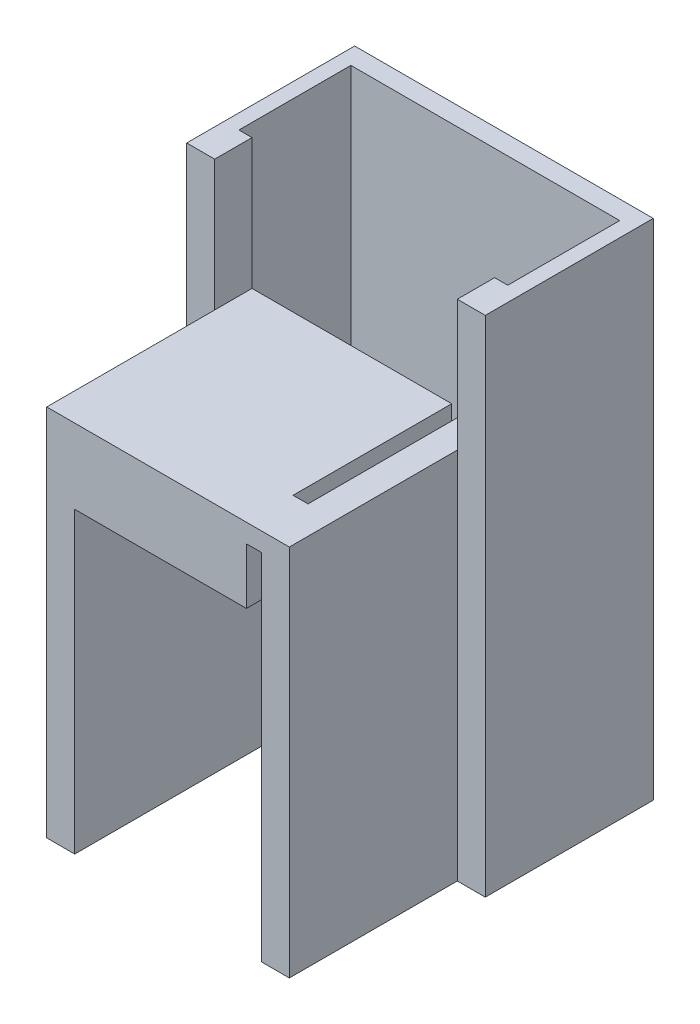
ISO-10303-21;
HEADER;
FILE_DESCRIPTION(('STEP AP214'),'2;1');
FILE_NAME('part.step','',(''),(''),'','','');
FILE_SCHEMA(('AUTOMOTIVE_DESIGN { 1 0 10303 214 1 1 1 1 }'));
ENDSEC;
DATA;
#1=APPLICATION_CONTEXT('core data for automotive mechanical design processes');
#2=APPLICATION_PROTOCOL_DEFINITION('international standard','automotive_design',2000,#1);
#3=PRODUCT_CONTEXT('',#1,'mechanical');
#4=PRODUCT('Part','Part','',(#3));
#5=PRODUCT_RELATED_PRODUCT_CATEGORY('part','',(#4));
#6=PRODUCT_DEFINITION_FORMATION('','',#4);
#7=PRODUCT_DEFINITION_CONTEXT('part definition',#1,'design');
#8=PRODUCT_DEFINITION('design','',#6,#7);
#9=PRODUCT_DEFINITION_SHAPE('','',#8);
#10=(LENGTH_UNIT() NAMED_UNIT(*) SI_UNIT(.MILLI.,.METRE.));
#11=(NAMED_UNIT(*) PLANE_ANGLE_UNIT() SI_UNIT($,.RADIAN.));
#12=(NAMED_UNIT(*) SI_UNIT($,.STERADIAN.) SOLID_ANGLE_UNIT());
#13=UNCERTAINTY_MEASURE_WITH_UNIT(LENGTH_MEASURE(1.E-05),#10,'distance_accuracy_value','');
#14=(GEOMETRIC_REPRESENTATION_CONTEXT(3) GLOBAL_UNCERTAINTY_ASSIGNED_CONTEXT((#13)) GLOBAL_UNIT_ASSIGNED_CONTEXT((#10,
#11,#12)) REPRESENTATION_CONTEXT('',''));
#15=CARTESIAN_POINT('',(0.,0.,0.));
#16=DIRECTION('',(0.,0.,1.));
#17=DIRECTION('',(1.,0.,0.));
#18=AXIS2_PLACEMENT_3D('',#15,#16,#17);
#19=CARTESIAN_POINT('',(-14.605,0.,-13.97));
#20=DIRECTION('',(-1.,0.,0.));
#21=DIRECTION('',(0.,0.,1.));
#22=AXIS2_PLACEMENT_3D('',#19,#20,#21);
#23=PLANE('',#22);
#24=DIRECTION('',(0.,0.,1.));
#25=VECTOR('',#24,1.);
#26=CARTESIAN_POINT('',(-14.605,25.4,-13.97));
#27=LINE('',#26,#25);
#28=CARTESIAN_POINT('',(-14.605,25.4,-11.43));
#29=VERTEX_POINT('',#28);
#30=CARTESIAN_POINT('',(-14.605,25.4,0.));
#31=VERTEX_POINT('',#30);
#32=EDGE_CURVE('E426',#29,#31,#27,.T.);
#33=ORIENTED_EDGE('',*,*,#32,.F.);
#34=DIRECTION('',(0.,-1.,0.));
#35=VECTOR('',#34,1.);
#36=CARTESIAN_POINT('',(-14.605,34.29,-11.43));
#37=LINE('',#36,#35);
#38=CARTESIAN_POINT('',(-14.605,0.,-11.43));
#39=VERTEX_POINT('',#38);
#40=EDGE_CURVE('E314',#29,#39,#37,.T.);
#41=ORIENTED_EDGE('',*,*,#40,.T.);
#42=DIRECTION('',(0.,0.,1.));
#43=VECTOR('',#42,1.);
#44=CARTESIAN_POINT('',(-14.605,0.,-13.97));
#45=LINE('',#44,#43);
#46=CARTESIAN_POINT('',(-14.605,0.,0.));
#47=VERTEX_POINT('',#46);
#48=EDGE_CURVE('E420',#39,#47,#45,.T.);
#49=ORIENTED_EDGE('',*,*,#48,.T.);
#50=DIRECTION('',(0.,-1.,0.));
#51=VECTOR('',#50,1.);
#52=CARTESIAN_POINT('',(-14.605,0.,0.));
#53=LINE('',#52,#51);
#54=EDGE_CURVE('E395',#31,#47,#53,.T.);
#55=ORIENTED_EDGE('',*,*,#54,.F.);
#56=EDGE_LOOP('',(#33,#41,#49,#55));
#57=FACE_BOUND('',#56,.T.);
#58=ADVANCED_FACE('F42',(#57),#23,.T.);
#59=CARTESIAN_POINT('',(1.905,25.4,-13.97));
#60=DIRECTION('',(1.,0.,0.));
#61=DIRECTION('',(0.,1.,0.));
#62=AXIS2_PLACEMENT_3D('',#59,#60,#61);
#63=PLANE('',#62);
#64=DIRECTION('',(0.,0.,1.));
#65=VECTOR('',#64,1.);
#66=CARTESIAN_POINT('',(1.905,0.,-13.97));
#67=LINE('',#66,#65);
#68=CARTESIAN_POINT('',(1.905,0.,-11.43));
#69=VERTEX_POINT('',#68);
#70=CARTESIAN_POINT('',(1.905,0.,0.));
#71=VERTEX_POINT('',#70);
#72=EDGE_CURVE('E46',#69,#71,#67,.T.);
#73=ORIENTED_EDGE('',*,*,#72,.F.);
#74=DIRECTION('',(0.,-1.,0.));
#75=VECTOR('',#74,1.);
#76=CARTESIAN_POINT('',(1.905,34.29,-11.43));
#77=LINE('',#76,#75);
#78=CARTESIAN_POINT('',(1.905,25.4,-11.43));
#79=VERTEX_POINT('',#78);
#80=EDGE_CURVE('E286',#79,#69,#77,.T.);
#81=ORIENTED_EDGE('',*,*,#80,.F.);
#82=DIRECTION('',(0.,0.,1.));
#83=VECTOR('',#82,1.);
#84=CARTESIAN_POINT('',(1.905,25.4,-13.97));
#85=LINE('',#84,#83);
#86=CARTESIAN_POINT('',(1.905,25.4,0.));
#87=VERTEX_POINT('',#86);
#88=EDGE_CURVE('E430',#79,#87,#85,.T.);
#89=ORIENTED_EDGE('',*,*,#88,.T.);
#90=DIRECTION('',(0.,1.,0.));
#91=VECTOR('',#90,1.);
#92=CARTESIAN_POINT('',(1.905,25.4,0.));
#93=LINE('',#92,#91);
#94=EDGE_CURVE('E387',#71,#87,#93,.T.);
#95=ORIENTED_EDGE('',*,*,#94,.F.);
#96=EDGE_LOOP('',(#73,#81,#89,#95));
#97=FACE_BOUND('',#96,.T.);
#98=ADVANCED_FACE('F44',(#97),#63,.T.);
#99=CARTESIAN_POINT('',(0.,0.,-13.97));
#100=DIRECTION('',(0.,0.,-1.));
#101=DIRECTION('',(-1.,0.,0.));
#102=AXIS2_PLACEMENT_3D('',#99,#100,#101);
#103=PLANE('',#102);
#104=DIRECTION('',(-1.,0.,0.));
#105=VECTOR('',#104,1.);
#106=CARTESIAN_POINT('',(-15.4971636435347,1.27,-13.97));
#107=LINE('',#106,#105);
#108=CARTESIAN_POINT('',(-12.7,1.27,-13.97));
#109=VERTEX_POINT('',#108);
#110=CARTESIAN_POINT('',(-15.4971636435347,1.27,-13.97));
#111=VERTEX_POINT('',#110);
#112=EDGE_CURVE('E468',#109,#111,#107,.T.);
#113=ORIENTED_EDGE('',*,*,#112,.T.);
#114=DIRECTION('',(0.,-1.,0.));
#115=VECTOR('',#114,1.);
#116=CARTESIAN_POINT('',(-15.4971636435347,34.29,-13.97));
#117=LINE('',#116,#115);
#118=CARTESIAN_POINT('',(-15.4971636435347,34.29,-13.97));
#119=VERTEX_POINT('',#118);
#120=EDGE_CURVE('E306',#119,#111,#117,.T.);
#121=ORIENTED_EDGE('',*,*,#120,.F.);
#122=DIRECTION('',(-1.,0.,0.));
#123=VECTOR('',#122,1.);
#124=CARTESIAN_POINT('',(-15.4971636435347,34.29,-13.97));
#125=LINE('',#124,#123);
#126=CARTESIAN_POINT('',(-14.605,34.29,-13.97));
#127=VERTEX_POINT('',#126);
#128=EDGE_CURVE('E268',#127,#119,#125,.T.);
#129=ORIENTED_EDGE('',*,*,#128,.F.);
#130=DIRECTION('',(0.,-1.,0.));
#131=VECTOR('',#130,1.);
#132=CARTESIAN_POINT('',(-14.605,34.29,-13.97));
#133=LINE('',#132,#131);
#134=CARTESIAN_POINT('',(-14.605,25.4,-13.97));
#135=VERTEX_POINT('',#134);
#136=EDGE_CURVE('E310',#127,#135,#133,.T.);
#137=ORIENTED_EDGE('',*,*,#136,.T.);
#138=DIRECTION('',(-1.,0.,0.));
#139=VECTOR('',#138,1.);
#140=CARTESIAN_POINT('',(-14.605,25.4,-13.97));
#141=LINE('',#140,#139);
#142=CARTESIAN_POINT('',(-1.016,25.4,-13.97));
#143=VERTEX_POINT('',#142);
#144=EDGE_CURVE('E373',#143,#135,#141,.T.);
#145=ORIENTED_EDGE('',*,*,#144,.F.);
#146=DIRECTION('',(0.,-1.,0.));
#147=VECTOR('',#146,1.);
#148=CARTESIAN_POINT('',(-1.016,24.13,-13.97));
#149=LINE('',#148,#147);
#150=CARTESIAN_POINT('',(-1.016,20.32,-13.97));
#151=VERTEX_POINT('',#150);
#152=EDGE_CURVE('E348',#143,#151,#149,.T.);
#153=ORIENTED_EDGE('',*,*,#152,.T.);
#154=DIRECTION('',(1.,0.,0.));
#155=VECTOR('',#154,1.);
#156=CARTESIAN_POINT('',(0.,20.32,-13.97));
#157=LINE('',#156,#155);
#158=CARTESIAN_POINT('',(-12.7,20.32,-13.97));
#159=VERTEX_POINT('',#158);
#160=EDGE_CURVE('E377',#159,#151,#157,.T.);
#161=ORIENTED_EDGE('',*,*,#160,.F.);
#162=DIRECTION('',(0.,1.,0.));
#163=VECTOR('',#162,1.);
#164=CARTESIAN_POINT('',(-12.7,20.32,-13.97));
#165=LINE('',#164,#163);
#166=EDGE_CURVE('E60',#109,#159,#165,.T.);
#167=ORIENTED_EDGE('',*,*,#166,.F.);
#168=EDGE_LOOP('',(#113,#121,#129,#137,#145,#153,#161,#167));
#169=FACE_BOUND('',#168,.T.);
#170=ADVANCED_FACE('F491',(#169),#103,.T.);
#171=CARTESIAN_POINT('',(0.,0.,-13.97));
#172=DIRECTION('',(-1.,0.,0.));
#173=DIRECTION('',(0.,-1.,0.));
#174=AXIS2_PLACEMENT_3D('',#171,#172,#173);
#175=PLANE('',#174);
#176=DIRECTION('',(0.,-1.,0.));
#177=VECTOR('',#176,1.);
#178=CARTESIAN_POINT('',(0.,0.,0.));
#179=LINE('',#178,#177);
#180=CARTESIAN_POINT('',(0.,24.13,0.));
#181=VERTEX_POINT('',#180);
#182=CARTESIAN_POINT('',(0.,0.,0.));
#183=VERTEX_POINT('',#182);
#184=EDGE_CURVE('E411',#181,#183,#179,.T.);
#185=ORIENTED_EDGE('',*,*,#184,.F.);
#186=DIRECTION('',(0.,0.,1.));
#187=VECTOR('',#186,1.);
#188=CARTESIAN_POINT('',(0.,24.13,-13.97));
#189=LINE('',#188,#187);
#190=CARTESIAN_POINT('',(0.,24.13,-3.175));
#191=VERTEX_POINT('',#190);
#192=EDGE_CURVE('E352',#191,#181,#189,.T.);
#193=ORIENTED_EDGE('',*,*,#192,.F.);
#194=DIRECTION('',(0.,-1.,0.));
#195=VECTOR('',#194,1.);
#196=CARTESIAN_POINT('',(0.,25.4,-3.175));
#197=LINE('',#196,#195);
#198=CARTESIAN_POINT('',(0.,25.4,-3.175));
#199=VERTEX_POINT('',#198);
#200=EDGE_CURVE('E338',#199,#191,#197,.T.);
#201=ORIENTED_EDGE('',*,*,#200,.F.);
#202=DIRECTION('',(0.,0.,1.));
#203=VECTOR('',#202,1.);
#204=CARTESIAN_POINT('',(0.,25.4,-3.175));
#205=LINE('',#204,#203);
#206=CARTESIAN_POINT('',(0.,25.4,-13.97));
#207=VERTEX_POINT('',#206);
#208=EDGE_CURVE('E330',#207,#199,#205,.T.);
#209=ORIENTED_EDGE('',*,*,#208,.F.);
#210=DIRECTION('',(0.,-1.,0.));
#211=VECTOR('',#210,1.);
#212=CARTESIAN_POINT('',(0.,0.,-13.97));
#213=LINE('',#212,#211);
#214=CARTESIAN_POINT('',(0.,1.27,-13.97));
#215=VERTEX_POINT('',#214);
#216=EDGE_CURVE('E381',#207,#215,#213,.T.);
#217=ORIENTED_EDGE('',*,*,#216,.T.);
#218=DIRECTION('',(0.,1.,0.));
#219=VECTOR('',#218,1.);
#220=CARTESIAN_POINT('',(0.,0.,-13.97));
#221=LINE('',#220,#219);
#222=CARTESIAN_POINT('',(0.,0.,-13.97));
#223=VERTEX_POINT('',#222);
#224=EDGE_CURVE('E235',#223,#215,#221,.T.);
#225=ORIENTED_EDGE('',*,*,#224,.F.);
#226=DIRECTION('',(0.,0.,1.));
#227=VECTOR('',#226,1.);
#228=CARTESIAN_POINT('',(0.,0.,-13.97));
#229=LINE('',#228,#227);
#230=EDGE_CURVE('E11',#223,#183,#229,.T.);
#231=ORIENTED_EDGE('',*,*,#230,.T.);
#232=EDGE_LOOP('',(#185,#193,#201,#209,#217,#225,#231));
#233=FACE_BOUND('',#232,.T.);
#234=ADVANCED_FACE('F451',(#233),#175,.T.);
#235=CARTESIAN_POINT('',(0.,20.32,-13.97));
#236=DIRECTION('',(0.,-1.,0.));
#237=DIRECTION('',(0.,0.,-1.));
#238=AXIS2_PLACEMENT_3D('',#235,#236,#237);
#239=PLANE('',#238);
#240=DIRECTION('',(0.,0.,1.));
#241=VECTOR('',#240,1.);
#242=CARTESIAN_POINT('',(-1.016,20.32,-13.97));
#243=LINE('',#242,#241);
#244=CARTESIAN_POINT('',(-1.016,20.32,0.));
#245=VERTEX_POINT('',#244);
#246=EDGE_CURVE('E359',#151,#245,#243,.T.);
#247=ORIENTED_EDGE('',*,*,#246,.T.);
#248=DIRECTION('',(1.,0.,0.));
#249=VECTOR('',#248,1.);
#250=CARTESIAN_POINT('',(0.,20.32,0.));
#251=LINE('',#250,#249);
#252=CARTESIAN_POINT('',(-12.7,20.32,0.));
#253=VERTEX_POINT('',#252);
#254=EDGE_CURVE('E407',#253,#245,#251,.T.);
#255=ORIENTED_EDGE('',*,*,#254,.F.);
#256=DIRECTION('',(0.,0.,1.));
#257=VECTOR('',#256,1.);
#258=CARTESIAN_POINT('',(-12.7,20.32,-13.97));
#259=LINE('',#258,#257);
#260=EDGE_CURVE('E52',#159,#253,#259,.T.);
#261=ORIENTED_EDGE('',*,*,#260,.F.);
#262=ORIENTED_EDGE('',*,*,#160,.T.);
#263=EDGE_LOOP('',(#247,#255,#261,#262));
#264=FACE_BOUND('',#263,.T.);
#265=ADVANCED_FACE('F525',(#264),#239,.T.);
#266=CARTESIAN_POINT('',(-12.7,20.32,-13.97));
#267=DIRECTION('',(1.,0.,0.));
#268=DIRECTION('',(0.,1.,0.));
#269=AXIS2_PLACEMENT_3D('',#266,#267,#268);
#270=PLANE('',#269);
#271=DIRECTION('',(0.,1.,0.));
#272=VECTOR('',#271,1.);
#273=CARTESIAN_POINT('',(-12.7,20.32,0.));
#274=LINE('',#273,#272);
#275=CARTESIAN_POINT('',(-12.7,0.,0.));
#276=VERTEX_POINT('',#275);
#277=EDGE_CURVE('E403',#276,#253,#274,.T.);
#278=ORIENTED_EDGE('',*,*,#277,.F.);
#279=DIRECTION('',(0.,0.,1.));
#280=VECTOR('',#279,1.);
#281=CARTESIAN_POINT('',(-12.7,0.,-13.97));
#282=LINE('',#281,#280);
#283=CARTESIAN_POINT('',(-12.7,0.,-13.97));
#284=VERTEX_POINT('',#283);
#285=EDGE_CURVE('E417',#284,#276,#282,.T.);
#286=ORIENTED_EDGE('',*,*,#285,.F.);
#287=EDGE_CURVE('E374',#284,#109,#165,.T.);
#288=ORIENTED_EDGE('',*,*,#287,.T.);
#289=ORIENTED_EDGE('',*,*,#166,.T.);
#290=ORIENTED_EDGE('',*,*,#260,.T.);
#291=EDGE_LOOP('',(#278,#286,#288,#289,#290));
#292=FACE_BOUND('',#291,.T.);
#293=ADVANCED_FACE('F521',(#292),#270,.T.);
#294=CARTESIAN_POINT('',(-12.7,0.,-13.97));
#295=DIRECTION('',(0.,-1.,0.));
#296=DIRECTION('',(1.,0.,0.));
#297=AXIS2_PLACEMENT_3D('',#294,#295,#296);
#298=PLANE('',#297);
#299=DIRECTION('',(-1.,0.,0.));
#300=VECTOR('',#299,1.);
#301=CARTESIAN_POINT('',(-15.4971636435347,0.,-13.97));
#302=LINE('',#301,#300);
#303=EDGE_CURVE('E453',#223,#284,#302,.T.);
#304=ORIENTED_EDGE('',*,*,#303,.T.);
#305=ORIENTED_EDGE('',*,*,#285,.T.);
#306=DIRECTION('',(1.,0.,0.));
#307=VECTOR('',#306,1.);
#308=CARTESIAN_POINT('',(-12.7,0.,0.));
#309=LINE('',#308,#307);
#310=EDGE_CURVE('E399',#47,#276,#309,.T.);
#311=ORIENTED_EDGE('',*,*,#310,.F.);
#312=ORIENTED_EDGE('',*,*,#48,.F.);
#313=DIRECTION('',(1.,0.,0.));
#314=VECTOR('',#313,1.);
#315=CARTESIAN_POINT('',(-16.51,0.,-11.43));
#316=LINE('',#315,#314);
#317=CARTESIAN_POINT('',(-16.51,0.,-11.43));
#318=VERTEX_POINT('',#317);
#319=EDGE_CURVE('E246',#318,#39,#316,.T.);
#320=ORIENTED_EDGE('',*,*,#319,.F.);
#321=DIRECTION('',(0.,0.,1.));
#322=VECTOR('',#321,1.);
#323=CARTESIAN_POINT('',(-16.51,0.,-22.86));
#324=LINE('',#323,#322);
#325=CARTESIAN_POINT('',(-16.51,0.,-22.86));
#326=VERTEX_POINT('',#325);
#327=EDGE_CURVE('E229',#326,#318,#324,.T.);
#328=ORIENTED_EDGE('',*,*,#327,.F.);
#329=DIRECTION('',(-1.,0.,0.));
#330=VECTOR('',#329,1.);
#331=CARTESIAN_POINT('',(3.80999999999999,0.,-22.86));
#332=LINE('',#331,#330);
#333=CARTESIAN_POINT('',(3.80999999999999,0.,-22.86));
#334=VERTEX_POINT('',#333);
#335=EDGE_CURVE('E211',#334,#326,#332,.T.);
#336=ORIENTED_EDGE('',*,*,#335,.F.);
#337=DIRECTION('',(0.,0.,-1.));
#338=VECTOR('',#337,1.);
#339=CARTESIAN_POINT('',(3.80999999999999,0.,-11.43));
#340=LINE('',#339,#338);
#341=CARTESIAN_POINT('',(3.80999999999999,0.,-11.43));
#342=VERTEX_POINT('',#341);
#343=EDGE_CURVE('E225',#342,#334,#340,.T.);
#344=ORIENTED_EDGE('',*,*,#343,.F.);
#345=DIRECTION('',(1.,0.,0.));
#346=VECTOR('',#345,1.);
#347=CARTESIAN_POINT('',(1.905,0.,-11.43));
#348=LINE('',#347,#346);
#349=EDGE_CURVE('E242',#69,#342,#348,.T.);
#350=ORIENTED_EDGE('',*,*,#349,.F.);
#351=ORIENTED_EDGE('',*,*,#72,.T.);
#352=DIRECTION('',(1.,0.,0.));
#353=VECTOR('',#352,1.);
#354=CARTESIAN_POINT('',(1.905,0.,0.));
#355=LINE('',#354,#353);
#356=EDGE_CURVE('E363',#183,#71,#355,.T.);
#357=ORIENTED_EDGE('',*,*,#356,.F.);
#358=ORIENTED_EDGE('',*,*,#230,.F.);
#359=EDGE_LOOP('',(#304,#305,#311,#312,#320,#328,#336,#344,#350,#351,#357,#358));
#360=FACE_BOUND('',#359,.T.);
#361=ADVANCED_FACE('F223',(#360),#298,.T.);
#362=CARTESIAN_POINT('',(-14.605,25.4,-13.97));
#363=DIRECTION('',(0.,1.,0.));
#364=DIRECTION('',(0.,0.,1.));
#365=AXIS2_PLACEMENT_3D('',#362,#363,#364);
#366=PLANE('',#365);
#367=DIRECTION('',(0.,0.,-1.));
#368=VECTOR('',#367,1.);
#369=CARTESIAN_POINT('',(-1.016,25.4,-13.97));
#370=LINE('',#369,#368);
#371=CARTESIAN_POINT('',(-1.016,25.4,-3.175));
#372=VERTEX_POINT('',#371);
#373=EDGE_CURVE('E326',#372,#143,#370,.T.);
#374=ORIENTED_EDGE('',*,*,#373,.T.);
#375=ORIENTED_EDGE('',*,*,#144,.T.);
#376=EDGE_CURVE('E423',#135,#29,#27,.T.);
#377=ORIENTED_EDGE('',*,*,#376,.T.);
#378=ORIENTED_EDGE('',*,*,#32,.T.);
#379=DIRECTION('',(-1.,0.,0.));
#380=VECTOR('',#379,1.);
#381=CARTESIAN_POINT('',(-14.605,25.4,0.));
#382=LINE('',#381,#380);
#383=EDGE_CURVE('E391',#87,#31,#382,.T.);
#384=ORIENTED_EDGE('',*,*,#383,.F.);
#385=ORIENTED_EDGE('',*,*,#88,.F.);
#386=CARTESIAN_POINT('',(1.905,25.4,-13.97));
#387=VERTEX_POINT('',#386);
#388=EDGE_CURVE('E427',#387,#79,#85,.T.);
#389=ORIENTED_EDGE('',*,*,#388,.F.);
#390=EDGE_CURVE('E369',#387,#207,#141,.T.);
#391=ORIENTED_EDGE('',*,*,#390,.T.);
#392=ORIENTED_EDGE('',*,*,#208,.T.);
#393=DIRECTION('',(-1.,0.,0.));
#394=VECTOR('',#393,1.);
#395=CARTESIAN_POINT('',(-1.016,25.4,-3.175));
#396=LINE('',#395,#394);
#397=EDGE_CURVE('E334',#199,#372,#396,.T.);
#398=ORIENTED_EDGE('',*,*,#397,.T.);
#399=EDGE_LOOP('',(#374,#375,#377,#378,#384,#385,#389,#391,#392,#398));
#400=FACE_BOUND('',#399,.T.);
#401=ADVANCED_FACE('F504',(#400),#366,.T.);
#402=CARTESIAN_POINT('',(2.79716364353466,1.27,-13.97));
#403=VERTEX_POINT('',#402);
#404=EDGE_CURVE('E68',#403,#215,#107,.T.);
#405=ORIENTED_EDGE('',*,*,#404,.T.);
#406=ORIENTED_EDGE('',*,*,#216,.F.);
#407=ORIENTED_EDGE('',*,*,#390,.F.);
#408=DIRECTION('',(0.,-1.,0.));
#409=VECTOR('',#408,1.);
#410=CARTESIAN_POINT('',(1.905,34.29,-13.97));
#411=LINE('',#410,#409);
#412=CARTESIAN_POINT('',(1.905,34.29,-13.97));
#413=VERTEX_POINT('',#412);
#414=EDGE_CURVE('E291',#413,#387,#411,.T.);
#415=ORIENTED_EDGE('',*,*,#414,.F.);
#416=DIRECTION('',(-1.,0.,0.));
#417=VECTOR('',#416,1.);
#418=CARTESIAN_POINT('',(2.79716364353466,34.29,-13.97));
#419=LINE('',#418,#417);
#420=CARTESIAN_POINT('',(2.79716364353466,34.29,-13.97));
#421=VERTEX_POINT('',#420);
#422=EDGE_CURVE('E280',#421,#413,#419,.T.);
#423=ORIENTED_EDGE('',*,*,#422,.F.);
#424=DIRECTION('',(0.,-1.,0.));
#425=VECTOR('',#424,1.);
#426=CARTESIAN_POINT('',(2.79716364353466,34.29,-13.97));
#427=LINE('',#426,#425);
#428=EDGE_CURVE('E295',#421,#403,#427,.T.);
#429=ORIENTED_EDGE('',*,*,#428,.T.);
#430=EDGE_LOOP('',(#405,#406,#407,#415,#423,#429));
#431=FACE_BOUND('',#430,.T.);
#432=ADVANCED_FACE('F538',(#431),#103,.T.);
#433=CARTESIAN_POINT('',(0.,0.,0.));
#434=DIRECTION('',(0.,0.,-1.));
#435=DIRECTION('',(-1.,0.,0.));
#436=AXIS2_PLACEMENT_3D('',#433,#434,#435);
#437=PLANE('',#436);
#438=ORIENTED_EDGE('',*,*,#254,.T.);
#439=DIRECTION('',(0.,-1.,0.));
#440=VECTOR('',#439,1.);
#441=CARTESIAN_POINT('',(-1.016,24.13,0.));
#442=LINE('',#441,#440);
#443=CARTESIAN_POINT('',(-1.016,24.13,0.));
#444=VERTEX_POINT('',#443);
#445=EDGE_CURVE('E353',#444,#245,#442,.T.);
#446=ORIENTED_EDGE('',*,*,#445,.F.);
#447=DIRECTION('',(-1.,0.,0.));
#448=VECTOR('',#447,1.);
#449=CARTESIAN_POINT('',(0.,24.13,0.));
#450=LINE('',#449,#448);
#451=EDGE_CURVE('E345',#181,#444,#450,.T.);
#452=ORIENTED_EDGE('',*,*,#451,.F.);
#453=ORIENTED_EDGE('',*,*,#184,.T.);
#454=ORIENTED_EDGE('',*,*,#356,.T.);
#455=ORIENTED_EDGE('',*,*,#94,.T.);
#456=ORIENTED_EDGE('',*,*,#383,.T.);
#457=ORIENTED_EDGE('',*,*,#54,.T.);
#458=ORIENTED_EDGE('',*,*,#310,.T.);
#459=ORIENTED_EDGE('',*,*,#277,.T.);
#460=EDGE_LOOP('',(#438,#446,#452,#453,#454,#455,#456,#457,#458,#459));
#461=FACE_BOUND('',#460,.T.);
#462=ADVANCED_FACE('F445',(#461),#437,.F.);
#463=CARTESIAN_POINT('',(-1.016,24.13,-13.97));
#464=DIRECTION('',(-1.,0.,0.));
#465=DIRECTION('',(0.,-1.,0.));
#466=AXIS2_PLACEMENT_3D('',#463,#464,#465);
#467=PLANE('',#466);
#468=ORIENTED_EDGE('',*,*,#445,.T.);
#469=ORIENTED_EDGE('',*,*,#246,.F.);
#470=ORIENTED_EDGE('',*,*,#152,.F.);
#471=ORIENTED_EDGE('',*,*,#373,.F.);
#472=DIRECTION('',(0.,-1.,0.));
#473=VECTOR('',#472,1.);
#474=CARTESIAN_POINT('',(-1.016,25.4,-3.175));
#475=LINE('',#474,#473);
#476=CARTESIAN_POINT('',(-1.016,24.13,-3.175));
#477=VERTEX_POINT('',#476);
#478=EDGE_CURVE('E342',#372,#477,#475,.T.);
#479=ORIENTED_EDGE('',*,*,#478,.T.);
#480=DIRECTION('',(0.,0.,1.));
#481=VECTOR('',#480,1.);
#482=CARTESIAN_POINT('',(-1.016,24.13,-13.97));
#483=LINE('',#482,#481);
#484=EDGE_CURVE('E364',#477,#444,#483,.T.);
#485=ORIENTED_EDGE('',*,*,#484,.T.);
#486=EDGE_LOOP('',(#468,#469,#470,#471,#479,#485));
#487=FACE_BOUND('',#486,.T.);
#488=ADVANCED_FACE('F527',(#487),#467,.F.);
#489=CARTESIAN_POINT('',(0.,24.13,-13.97));
#490=DIRECTION('',(0.,1.,0.));
#491=DIRECTION('',(0.,0.,1.));
#492=AXIS2_PLACEMENT_3D('',#489,#490,#491);
#493=PLANE('',#492);
#494=ORIENTED_EDGE('',*,*,#484,.F.);
#495=DIRECTION('',(-1.,0.,0.));
#496=VECTOR('',#495,1.);
#497=CARTESIAN_POINT('',(-1.016,24.13,-3.175));
#498=LINE('',#497,#496);
#499=EDGE_CURVE('E325',#191,#477,#498,.T.);
#500=ORIENTED_EDGE('',*,*,#499,.F.);
#501=ORIENTED_EDGE('',*,*,#192,.T.);
#502=ORIENTED_EDGE('',*,*,#451,.T.);
#503=EDGE_LOOP('',(#494,#500,#501,#502));
#504=FACE_BOUND('',#503,.T.);
#505=ADVANCED_FACE('F532',(#504),#493,.F.);
#506=CARTESIAN_POINT('',(-1.016,25.4,-3.175));
#507=DIRECTION('',(0.,0.,1.));
#508=DIRECTION('',(1.,0.,0.));
#509=AXIS2_PLACEMENT_3D('',#506,#507,#508);
#510=PLANE('',#509);
#511=ORIENTED_EDGE('',*,*,#499,.T.);
#512=ORIENTED_EDGE('',*,*,#478,.F.);
#513=ORIENTED_EDGE('',*,*,#397,.F.);
#514=ORIENTED_EDGE('',*,*,#200,.T.);
#515=EDGE_LOOP('',(#511,#512,#513,#514));
#516=FACE_BOUND('',#515,.T.);
#517=ADVANCED_FACE('F534',(#516),#510,.F.);
#518=CARTESIAN_POINT('',(1.905,34.29,-11.43));
#519=DIRECTION('',(0.,0.,-1.));
#520=DIRECTION('',(-1.,0.,0.));
#521=AXIS2_PLACEMENT_3D('',#518,#519,#520);
#522=PLANE('',#521);
#523=CARTESIAN_POINT('',(1.905,34.29,-11.43));
#524=VERTEX_POINT('',#523);
#525=EDGE_CURVE('E287',#524,#79,#77,.T.);
#526=ORIENTED_EDGE('',*,*,#525,.T.);
#527=ORIENTED_EDGE('',*,*,#80,.T.);
#528=ORIENTED_EDGE('',*,*,#349,.T.);
#529=DIRECTION('',(0.,-1.,0.));
#530=VECTOR('',#529,1.);
#531=CARTESIAN_POINT('',(3.80999999999999,34.29,-11.43));
#532=LINE('',#531,#530);
#533=CARTESIAN_POINT('',(3.80999999999999,34.29,-11.43));
#534=VERTEX_POINT('',#533);
#535=EDGE_CURVE('E216',#534,#342,#532,.T.);
#536=ORIENTED_EDGE('',*,*,#535,.F.);
#537=DIRECTION('',(1.,0.,0.));
#538=VECTOR('',#537,1.);
#539=CARTESIAN_POINT('',(1.905,34.29,-11.43));
#540=LINE('',#539,#538);
#541=EDGE_CURVE('E245',#524,#534,#540,.T.);
#542=ORIENTED_EDGE('',*,*,#541,.F.);
#543=EDGE_LOOP('',(#526,#527,#528,#536,#542));
#544=FACE_BOUND('',#543,.T.);
#545=ADVANCED_FACE('F511',(#544),#522,.F.);
#546=CARTESIAN_POINT('',(3.80999999999999,34.29,-11.43));
#547=DIRECTION('',(-1.,0.,0.));
#548=DIRECTION('',(0.,0.,1.));
#549=AXIS2_PLACEMENT_3D('',#546,#547,#548);
#550=PLANE('',#549);
#551=ORIENTED_EDGE('',*,*,#535,.T.);
#552=ORIENTED_EDGE('',*,*,#343,.T.);
#553=DIRECTION('',(0.,-1.,0.));
#554=VECTOR('',#553,1.);
#555=CARTESIAN_POINT('',(3.80999999999999,34.29,-22.86));
#556=LINE('',#555,#554);
#557=CARTESIAN_POINT('',(3.80999999999999,34.29,-22.86));
#558=VERTEX_POINT('',#557);
#559=EDGE_CURVE('E207',#558,#334,#556,.T.);
#560=ORIENTED_EDGE('',*,*,#559,.F.);
#561=DIRECTION('',(0.,0.,-1.));
#562=VECTOR('',#561,1.);
#563=CARTESIAN_POINT('',(3.80999999999999,34.29,-11.43));
#564=LINE('',#563,#562);
#565=EDGE_CURVE('E254',#534,#558,#564,.T.);
#566=ORIENTED_EDGE('',*,*,#565,.F.);
#567=EDGE_LOOP('',(#551,#552,#560,#566));
#568=FACE_BOUND('',#567,.T.);
#569=ADVANCED_FACE('F232',(#568),#550,.F.);
#570=CARTESIAN_POINT('',(3.80999999999999,34.29,-22.86));
#571=DIRECTION('',(0.,0.,1.));
#572=DIRECTION('',(1.,0.,0.));
#573=AXIS2_PLACEMENT_3D('',#570,#571,#572);
#574=PLANE('',#573);
#575=ORIENTED_EDGE('',*,*,#559,.T.);
#576=ORIENTED_EDGE('',*,*,#335,.T.);
#577=DIRECTION('',(0.,-1.,0.));
#578=VECTOR('',#577,1.);
#579=CARTESIAN_POINT('',(-16.51,34.29,-22.86));
#580=LINE('',#579,#578);
#581=CARTESIAN_POINT('',(-16.51,34.29,-22.86));
#582=VERTEX_POINT('',#581);
#583=EDGE_CURVE('E217',#582,#326,#580,.T.);
#584=ORIENTED_EDGE('',*,*,#583,.F.);
#585=DIRECTION('',(-1.,0.,0.));
#586=VECTOR('',#585,1.);
#587=CARTESIAN_POINT('',(3.80999999999999,34.29,-22.86));
#588=LINE('',#587,#586);
#589=EDGE_CURVE('E212',#558,#582,#588,.T.);
#590=ORIENTED_EDGE('',*,*,#589,.F.);
#591=EDGE_LOOP('',(#575,#576,#584,#590));
#592=FACE_BOUND('',#591,.T.);
#593=ADVANCED_FACE('F209',(#592),#574,.F.);
#594=CARTESIAN_POINT('',(-16.51,34.29,-22.86));
#595=DIRECTION('',(1.,0.,0.));
#596=DIRECTION('',(0.,0.,-1.));
#597=AXIS2_PLACEMENT_3D('',#594,#595,#596);
#598=PLANE('',#597);
#599=ORIENTED_EDGE('',*,*,#583,.T.);
#600=ORIENTED_EDGE('',*,*,#327,.T.);
#601=DIRECTION('',(0.,-1.,0.));
#602=VECTOR('',#601,1.);
#603=CARTESIAN_POINT('',(-16.51,34.29,-11.43));
#604=LINE('',#603,#602);
#605=CARTESIAN_POINT('',(-16.51,34.29,-11.43));
#606=VERTEX_POINT('',#605);
#607=EDGE_CURVE('E318',#606,#318,#604,.T.);
#608=ORIENTED_EDGE('',*,*,#607,.F.);
#609=DIRECTION('',(0.,0.,1.));
#610=VECTOR('',#609,1.);
#611=CARTESIAN_POINT('',(-16.51,34.29,-22.86));
#612=LINE('',#611,#610);
#613=EDGE_CURVE('E259',#582,#606,#612,.T.);
#614=ORIENTED_EDGE('',*,*,#613,.F.);
#615=EDGE_LOOP('',(#599,#600,#608,#614));
#616=FACE_BOUND('',#615,.T.);
#617=ADVANCED_FACE('F545',(#616),#598,.F.);
#618=CARTESIAN_POINT('',(-16.51,34.29,-11.43));
#619=DIRECTION('',(0.,0.,-1.));
#620=DIRECTION('',(-1.,0.,0.));
#621=AXIS2_PLACEMENT_3D('',#618,#619,#620);
#622=PLANE('',#621);
#623=ORIENTED_EDGE('',*,*,#607,.T.);
#624=ORIENTED_EDGE('',*,*,#319,.T.);
#625=ORIENTED_EDGE('',*,*,#40,.F.);
#626=CARTESIAN_POINT('',(-14.605,34.29,-11.43));
#627=VERTEX_POINT('',#626);
#628=EDGE_CURVE('E315',#627,#29,#37,.T.);
#629=ORIENTED_EDGE('',*,*,#628,.F.);
#630=DIRECTION('',(1.,0.,0.));
#631=VECTOR('',#630,1.);
#632=CARTESIAN_POINT('',(-16.51,34.29,-11.43));
#633=LINE('',#632,#631);
#634=EDGE_CURVE('E262',#606,#627,#633,.T.);
#635=ORIENTED_EDGE('',*,*,#634,.F.);
#636=EDGE_LOOP('',(#623,#624,#625,#629,#635));
#637=FACE_BOUND('',#636,.T.);
#638=ADVANCED_FACE('F549',(#637),#622,.F.);
#639=CARTESIAN_POINT('',(-14.605,34.29,-13.97));
#640=DIRECTION('',(-1.,0.,0.));
#641=DIRECTION('',(0.,0.,1.));
#642=AXIS2_PLACEMENT_3D('',#639,#640,#641);
#643=PLANE('',#642);
#644=ORIENTED_EDGE('',*,*,#376,.F.);
#645=ORIENTED_EDGE('',*,*,#136,.F.);
#646=DIRECTION('',(0.,0.,-1.));
#647=VECTOR('',#646,1.);
#648=CARTESIAN_POINT('',(-14.605,34.29,-13.97));
#649=LINE('',#648,#647);
#650=EDGE_CURVE('E265',#627,#127,#649,.T.);
#651=ORIENTED_EDGE('',*,*,#650,.F.);
#652=ORIENTED_EDGE('',*,*,#628,.T.);
#653=EDGE_LOOP('',(#644,#645,#651,#652));
#654=FACE_BOUND('',#653,.T.);
#655=ADVANCED_FACE('F550',(#654),#643,.F.);
#656=CARTESIAN_POINT('',(-15.4971636435347,34.29,-21.59));
#657=DIRECTION('',(-1.,0.,0.));
#658=DIRECTION('',(0.,0.,1.));
#659=AXIS2_PLACEMENT_3D('',#656,#657,#658);
#660=PLANE('',#659);
#661=ORIENTED_EDGE('',*,*,#120,.T.);
#662=DIRECTION('',(0.,0.,-1.));
#663=VECTOR('',#662,1.);
#664=CARTESIAN_POINT('',(-15.4971636435347,1.27,-21.59));
#665=LINE('',#664,#663);
#666=CARTESIAN_POINT('',(-15.4971636435347,1.27,-21.59));
#667=VERTEX_POINT('',#666);
#668=EDGE_CURVE('E460',#111,#667,#665,.T.);
#669=ORIENTED_EDGE('',*,*,#668,.T.);
#670=DIRECTION('',(0.,-1.,0.));
#671=VECTOR('',#670,1.);
#672=CARTESIAN_POINT('',(-15.4971636435347,34.29,-21.59));
#673=LINE('',#672,#671);
#674=CARTESIAN_POINT('',(-15.4971636435347,34.29,-21.59));
#675=VERTEX_POINT('',#674);
#676=EDGE_CURVE('E302',#675,#667,#673,.T.);
#677=ORIENTED_EDGE('',*,*,#676,.F.);
#678=DIRECTION('',(0.,0.,-1.));
#679=VECTOR('',#678,1.);
#680=CARTESIAN_POINT('',(-15.4971636435347,34.29,-21.59));
#681=LINE('',#680,#679);
#682=EDGE_CURVE('E271',#119,#675,#681,.T.);
#683=ORIENTED_EDGE('',*,*,#682,.F.);
#684=EDGE_LOOP('',(#661,#669,#677,#683));
#685=FACE_BOUND('',#684,.T.);
#686=ADVANCED_FACE('F495',(#685),#660,.F.);
#687=CARTESIAN_POINT('',(2.79716364353466,34.29,-21.59));
#688=DIRECTION('',(0.,0.,-1.));
#689=DIRECTION('',(-1.,0.,0.));
#690=AXIS2_PLACEMENT_3D('',#687,#688,#689);
#691=PLANE('',#690);
#692=ORIENTED_EDGE('',*,*,#676,.T.);
#693=DIRECTION('',(1.,0.,0.));
#694=VECTOR('',#693,1.);
#695=CARTESIAN_POINT('',(2.79716364353466,1.27,-21.59));
#696=LINE('',#695,#694);
#697=CARTESIAN_POINT('',(2.79716364353466,1.27,-21.59));
#698=VERTEX_POINT('',#697);
#699=EDGE_CURVE('E462',#667,#698,#696,.T.);
#700=ORIENTED_EDGE('',*,*,#699,.T.);
#701=DIRECTION('',(0.,-1.,0.));
#702=VECTOR('',#701,1.);
#703=CARTESIAN_POINT('',(2.79716364353466,34.29,-21.59));
#704=LINE('',#703,#702);
#705=CARTESIAN_POINT('',(2.79716364353466,34.29,-21.59));
#706=VERTEX_POINT('',#705);
#707=EDGE_CURVE('E298',#706,#698,#704,.T.);
#708=ORIENTED_EDGE('',*,*,#707,.F.);
#709=DIRECTION('',(1.,0.,0.));
#710=VECTOR('',#709,1.);
#711=CARTESIAN_POINT('',(2.79716364353466,34.29,-21.59));
#712=LINE('',#711,#710);
#713=EDGE_CURVE('E274',#675,#706,#712,.T.);
#714=ORIENTED_EDGE('',*,*,#713,.F.);
#715=EDGE_LOOP('',(#692,#700,#708,#714));
#716=FACE_BOUND('',#715,.T.);
#717=ADVANCED_FACE('F476',(#716),#691,.F.);
#718=CARTESIAN_POINT('',(2.79716364353466,34.29,-13.97));
#719=DIRECTION('',(1.,0.,0.));
#720=DIRECTION('',(0.,0.,-1.));
#721=AXIS2_PLACEMENT_3D('',#718,#719,#720);
#722=PLANE('',#721);
#723=ORIENTED_EDGE('',*,*,#707,.T.);
#724=DIRECTION('',(0.,0.,1.));
#725=VECTOR('',#724,1.);
#726=CARTESIAN_POINT('',(2.79716364353466,1.27,-13.97));
#727=LINE('',#726,#725);
#728=EDGE_CURVE('E469',#698,#403,#727,.T.);
#729=ORIENTED_EDGE('',*,*,#728,.T.);
#730=ORIENTED_EDGE('',*,*,#428,.F.);
#731=DIRECTION('',(0.,0.,1.));
#732=VECTOR('',#731,1.);
#733=CARTESIAN_POINT('',(2.79716364353466,34.29,-13.97));
#734=LINE('',#733,#732);
#735=EDGE_CURVE('E277',#706,#421,#734,.T.);
#736=ORIENTED_EDGE('',*,*,#735,.F.);
#737=EDGE_LOOP('',(#723,#729,#730,#736));
#738=FACE_BOUND('',#737,.T.);
#739=ADVANCED_FACE('F484',(#738),#722,.F.);
#740=CARTESIAN_POINT('',(1.905,34.29,-13.97));
#741=DIRECTION('',(1.,0.,0.));
#742=DIRECTION('',(0.,0.,-1.));
#743=AXIS2_PLACEMENT_3D('',#740,#741,#742);
#744=PLANE('',#743);
#745=ORIENTED_EDGE('',*,*,#388,.T.);
#746=ORIENTED_EDGE('',*,*,#525,.F.);
#747=DIRECTION('',(0.,0.,1.));
#748=VECTOR('',#747,1.);
#749=CARTESIAN_POINT('',(1.905,34.29,-13.97));
#750=LINE('',#749,#748);
#751=EDGE_CURVE('E283',#413,#524,#750,.T.);
#752=ORIENTED_EDGE('',*,*,#751,.F.);
#753=ORIENTED_EDGE('',*,*,#414,.T.);
#754=EDGE_LOOP('',(#745,#746,#752,#753));
#755=FACE_BOUND('',#754,.T.);
#756=ADVANCED_FACE('F541',(#755),#744,.F.);
#757=CARTESIAN_POINT('',(0.,34.29,0.));
#758=DIRECTION('',(0.,1.,0.));
#759=DIRECTION('',(0.,0.,1.));
#760=AXIS2_PLACEMENT_3D('',#757,#758,#759);
#761=PLANE('',#760);
#762=ORIENTED_EDGE('',*,*,#541,.T.);
#763=ORIENTED_EDGE('',*,*,#565,.T.);
#764=ORIENTED_EDGE('',*,*,#589,.T.);
#765=ORIENTED_EDGE('',*,*,#613,.T.);
#766=ORIENTED_EDGE('',*,*,#634,.T.);
#767=ORIENTED_EDGE('',*,*,#650,.T.);
#768=ORIENTED_EDGE('',*,*,#128,.T.);
#769=ORIENTED_EDGE('',*,*,#682,.T.);
#770=ORIENTED_EDGE('',*,*,#713,.T.);
#771=ORIENTED_EDGE('',*,*,#735,.T.);
#772=ORIENTED_EDGE('',*,*,#422,.T.);
#773=ORIENTED_EDGE('',*,*,#751,.T.);
#774=EDGE_LOOP('',(#762,#763,#764,#765,#766,#767,#768,#769,#770,#771,#772,#773));
#775=FACE_BOUND('',#774,.T.);
#776=ADVANCED_FACE('F497',(#775),#761,.T.);
#777=CARTESIAN_POINT('',(-15.4971636435347,1.27,-13.97));
#778=DIRECTION('',(0.,0.,1.));
#779=DIRECTION('',(1.,0.,0.));
#780=AXIS2_PLACEMENT_3D('',#777,#778,#779);
#781=PLANE('',#780);
#782=ORIENTED_EDGE('',*,*,#303,.F.);
#783=ORIENTED_EDGE('',*,*,#224,.T.);
#784=EDGE_CURVE('E467',#215,#109,#107,.T.);
#785=ORIENTED_EDGE('',*,*,#784,.T.);
#786=ORIENTED_EDGE('',*,*,#287,.F.);
#787=EDGE_LOOP('',(#782,#783,#785,#786));
#788=FACE_BOUND('',#787,.T.);
#789=ADVANCED_FACE('F456',(#788),#781,.T.);
#790=CARTESIAN_POINT('',(0.,1.27,0.));
#791=DIRECTION('',(0.,1.,0.));
#792=DIRECTION('',(-1.,0.,0.));
#793=AXIS2_PLACEMENT_3D('',#790,#791,#792);
#794=PLANE('',#793);
#795=ORIENTED_EDGE('',*,*,#668,.F.);
#796=ORIENTED_EDGE('',*,*,#112,.F.);
#797=ORIENTED_EDGE('',*,*,#784,.F.);
#798=ORIENTED_EDGE('',*,*,#404,.F.);
#799=ORIENTED_EDGE('',*,*,#728,.F.);
#800=ORIENTED_EDGE('',*,*,#699,.F.);
#801=EDGE_LOOP('',(#795,#796,#797,#798,#799,#800));
#802=FACE_BOUND('',#801,.T.);
#803=ADVANCED_FACE('F486',(#802),#794,.T.);
#804=CLOSED_SHELL('',(#58,#98,#170,#234,#265,#293,#361,#401,#432,#462,#488,#505,#517,#545,#569,
#593,#617,#638,#655,#686,#717,#739,#756,#776,#789,#803));
#805=MANIFOLD_SOLID_BREP('B2',#804);
#806=ADVANCED_BREP_SHAPE_REPRESENTATION('',(#18,#805),#14);
#807=SHAPE_DEFINITION_REPRESENTATION(#9,#806);
ENDSEC;
END-ISO-10303-21;
